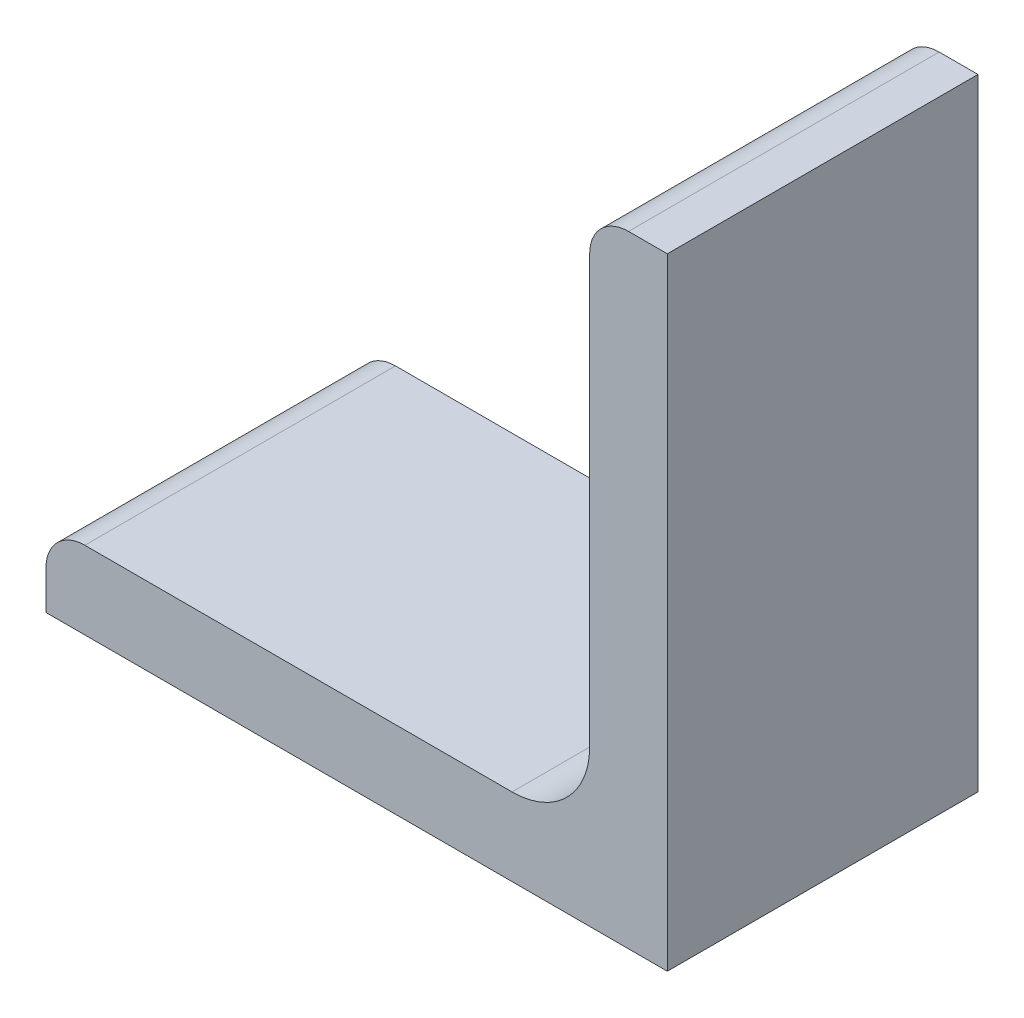
ISO-10303-21;
HEADER;
FILE_DESCRIPTION(('STEP AP214'),'2;1');
FILE_NAME('part.step','',(''),(''),'','','');
FILE_SCHEMA(('AUTOMOTIVE_DESIGN { 1 0 10303 214 1 1 1 1 }'));
ENDSEC;
DATA;
#1=APPLICATION_CONTEXT('core data for automotive mechanical design processes');
#2=APPLICATION_PROTOCOL_DEFINITION('international standard','automotive_design',2000,#1);
#3=PRODUCT_CONTEXT('',#1,'mechanical');
#4=PRODUCT('Part','Part','',(#3));
#5=PRODUCT_RELATED_PRODUCT_CATEGORY('part','',(#4));
#6=PRODUCT_DEFINITION_FORMATION('','',#4);
#7=PRODUCT_DEFINITION_CONTEXT('part definition',#1,'design');
#8=PRODUCT_DEFINITION('design','',#6,#7);
#9=PRODUCT_DEFINITION_SHAPE('','',#8);
#10=(LENGTH_UNIT() NAMED_UNIT(*) SI_UNIT(.MILLI.,.METRE.));
#11=(NAMED_UNIT(*) PLANE_ANGLE_UNIT() SI_UNIT($,.RADIAN.));
#12=(NAMED_UNIT(*) SI_UNIT($,.STERADIAN.) SOLID_ANGLE_UNIT());
#13=UNCERTAINTY_MEASURE_WITH_UNIT(LENGTH_MEASURE(1.E-05),#10,'distance_accuracy_value','');
#14=(GEOMETRIC_REPRESENTATION_CONTEXT(3) GLOBAL_UNCERTAINTY_ASSIGNED_CONTEXT((#13)) GLOBAL_UNIT_ASSIGNED_CONTEXT((#10,
#11,#12)) REPRESENTATION_CONTEXT('',''));
#15=CARTESIAN_POINT('',(0.,0.,0.));
#16=DIRECTION('',(0.,0.,1.));
#17=DIRECTION('',(1.,0.,0.));
#18=AXIS2_PLACEMENT_3D('',#15,#16,#17);
#19=CARTESIAN_POINT('',(-12.7,-11.1125,152.4));
#20=DIRECTION('',(1.,0.,0.));
#21=DIRECTION('',(0.,0.,-1.));
#22=AXIS2_PLACEMENT_3D('',#19,#20,#21);
#23=PLANE('',#22);
#24=DIRECTION('',(0.,0.,-1.));
#25=VECTOR('',#24,1.);
#26=CARTESIAN_POINT('',(-12.7,-11.1125,152.4));
#27=LINE('',#26,#25);
#28=CARTESIAN_POINT('',(-12.7,-11.1125,152.4));
#29=VERTEX_POINT('',#28);
#30=CARTESIAN_POINT('',(-12.7,-11.1125,139.7));
#31=VERTEX_POINT('',#30);
#32=EDGE_CURVE('E147',#29,#31,#27,.T.);
#33=ORIENTED_EDGE('',*,*,#32,.T.);
#34=DIRECTION('',(0.,-1.,0.));
#35=VECTOR('',#34,1.);
#36=CARTESIAN_POINT('',(-12.7,-11.1125,139.7));
#37=LINE('',#36,#35);
#38=CARTESIAN_POINT('',(-12.7,-12.7,139.7));
#39=VERTEX_POINT('',#38);
#40=EDGE_CURVE('E52',#31,#39,#37,.T.);
#41=ORIENTED_EDGE('',*,*,#40,.T.);
#42=DIRECTION('',(0.,0.,-1.));
#43=VECTOR('',#42,1.);
#44=CARTESIAN_POINT('',(-12.7,-12.7,152.4));
#45=LINE('',#44,#43);
#46=CARTESIAN_POINT('',(-12.7,-12.7,152.4));
#47=VERTEX_POINT('',#46);
#48=EDGE_CURVE('E45',#47,#39,#45,.T.);
#49=ORIENTED_EDGE('',*,*,#48,.F.);
#50=DIRECTION('',(0.,-1.,0.));
#51=VECTOR('',#50,1.);
#52=CARTESIAN_POINT('',(-12.7,-11.1125,152.4));
#53=LINE('',#52,#51);
#54=EDGE_CURVE('E116',#29,#47,#53,.T.);
#55=ORIENTED_EDGE('',*,*,#54,.F.);
#56=EDGE_LOOP('',(#33,#41,#49,#55));
#57=FACE_BOUND('',#56,.T.);
#58=ADVANCED_FACE('F38',(#57),#23,.F.);
#59=CARTESIAN_POINT('',(-12.7,-12.7,152.4));
#60=DIRECTION('',(0.,1.,0.));
#61=DIRECTION('',(-1.,0.,0.));
#62=AXIS2_PLACEMENT_3D('',#59,#60,#61);
#63=PLANE('',#62);
#64=ORIENTED_EDGE('',*,*,#48,.T.);
#65=DIRECTION('',(-1.,0.,0.));
#66=VECTOR('',#65,1.);
#67=CARTESIAN_POINT('',(-18.619943121302,-12.7,139.7));
#68=LINE('',#67,#66);
#69=CARTESIAN_POINT('',(12.7,-12.7,139.7));
#70=VERTEX_POINT('',#69);
#71=EDGE_CURVE('E109',#70,#39,#68,.T.);
#72=ORIENTED_EDGE('',*,*,#71,.F.);
#73=DIRECTION('',(0.,0.,-1.));
#74=VECTOR('',#73,1.);
#75=CARTESIAN_POINT('',(12.7,-12.7,152.4));
#76=LINE('',#75,#74);
#77=CARTESIAN_POINT('',(12.7,-12.7,152.4));
#78=VERTEX_POINT('',#77);
#79=EDGE_CURVE('E122',#78,#70,#76,.T.);
#80=ORIENTED_EDGE('',*,*,#79,.F.);
#81=DIRECTION('',(1.,0.,0.));
#82=VECTOR('',#81,1.);
#83=CARTESIAN_POINT('',(-12.7,-12.7,152.4));
#84=LINE('',#83,#82);
#85=EDGE_CURVE('E162',#47,#78,#84,.T.);
#86=ORIENTED_EDGE('',*,*,#85,.F.);
#87=EDGE_LOOP('',(#64,#72,#80,#86));
#88=FACE_BOUND('',#87,.T.);
#89=ADVANCED_FACE('F121',(#88),#63,.F.);
#90=CARTESIAN_POINT('',(12.7,-12.7,152.4));
#91=DIRECTION('',(-1.,0.,0.));
#92=DIRECTION('',(0.,-1.,0.));
#93=AXIS2_PLACEMENT_3D('',#90,#91,#92);
#94=PLANE('',#93);
#95=ORIENTED_EDGE('',*,*,#79,.T.);
#96=DIRECTION('',(0.,1.,0.));
#97=VECTOR('',#96,1.);
#98=CARTESIAN_POINT('',(12.7,-12.7,139.7));
#99=LINE('',#98,#97);
#100=CARTESIAN_POINT('',(12.7,12.7,139.7));
#101=VERTEX_POINT('',#100);
#102=EDGE_CURVE('E106',#70,#101,#99,.T.);
#103=ORIENTED_EDGE('',*,*,#102,.T.);
#104=DIRECTION('',(0.,0.,-1.));
#105=VECTOR('',#104,1.);
#106=CARTESIAN_POINT('',(12.7,12.7,152.4));
#107=LINE('',#106,#105);
#108=CARTESIAN_POINT('',(12.7,12.7,152.4));
#109=VERTEX_POINT('',#108);
#110=EDGE_CURVE('E128',#109,#101,#107,.T.);
#111=ORIENTED_EDGE('',*,*,#110,.F.);
#112=DIRECTION('',(0.,1.,0.));
#113=VECTOR('',#112,1.);
#114=CARTESIAN_POINT('',(12.7,-12.7,152.4));
#115=LINE('',#114,#113);
#116=EDGE_CURVE('E127',#78,#109,#115,.T.);
#117=ORIENTED_EDGE('',*,*,#116,.F.);
#118=EDGE_LOOP('',(#95,#103,#111,#117));
#119=FACE_BOUND('',#118,.T.);
#120=ADVANCED_FACE('F126',(#119),#94,.F.);
#121=CARTESIAN_POINT('',(11.1125,12.7,152.4));
#122=DIRECTION('',(0.,-1.,0.));
#123=DIRECTION('',(0.,0.,-1.));
#124=AXIS2_PLACEMENT_3D('',#121,#122,#123);
#125=PLANE('',#124);
#126=ORIENTED_EDGE('',*,*,#110,.T.);
#127=DIRECTION('',(-1.,0.,0.));
#128=VECTOR('',#127,1.);
#129=CARTESIAN_POINT('',(-18.619943121302,12.7,139.7));
#130=LINE('',#129,#128);
#131=CARTESIAN_POINT('',(11.1125,12.7,139.7));
#132=VERTEX_POINT('',#131);
#133=EDGE_CURVE('E111',#101,#132,#130,.T.);
#134=ORIENTED_EDGE('',*,*,#133,.T.);
#135=DIRECTION('',(0.,0.,-1.));
#136=VECTOR('',#135,1.);
#137=CARTESIAN_POINT('',(11.1125,12.7,152.4));
#138=LINE('',#137,#136);
#139=CARTESIAN_POINT('',(11.1125,12.7,152.4));
#140=VERTEX_POINT('',#139);
#141=EDGE_CURVE('E130',#140,#132,#138,.T.);
#142=ORIENTED_EDGE('',*,*,#141,.F.);
#143=DIRECTION('',(-1.,0.,0.));
#144=VECTOR('',#143,1.);
#145=CARTESIAN_POINT('',(11.1125,12.7,152.4));
#146=LINE('',#145,#144);
#147=EDGE_CURVE('E159',#109,#140,#146,.T.);
#148=ORIENTED_EDGE('',*,*,#147,.F.);
#149=EDGE_LOOP('',(#126,#134,#142,#148));
#150=FACE_BOUND('',#149,.T.);
#151=ADVANCED_FACE('F180',(#150),#125,.F.);
#152=CARTESIAN_POINT('',(11.1125,11.1125,152.4));
#153=DIRECTION('',(0.,0.,-1.));
#154=DIRECTION('',(-1.,0.,0.));
#155=AXIS2_PLACEMENT_3D('',#152,#153,#154);
#156=CYLINDRICAL_SURFACE('',#155,1.5875);
#157=ORIENTED_EDGE('',*,*,#141,.T.);
#158=CARTESIAN_POINT('',(11.1125,11.1125,139.7));
#159=DIRECTION('',(0.,0.,1.));
#160=DIRECTION('',(1.,0.,0.));
#161=AXIS2_PLACEMENT_3D('',#158,#159,#160);
#162=CIRCLE('',#161,1.5875);
#163=CARTESIAN_POINT('',(9.525,11.1125,139.7));
#164=VERTEX_POINT('',#163);
#165=EDGE_CURVE('E166',#132,#164,#162,.T.);
#166=ORIENTED_EDGE('',*,*,#165,.T.);
#167=DIRECTION('',(0.,0.,-1.));
#168=VECTOR('',#167,1.);
#169=CARTESIAN_POINT('',(9.525,11.1125,152.4));
#170=LINE('',#169,#168);
#171=CARTESIAN_POINT('',(9.525,11.1125,152.4));
#172=VERTEX_POINT('',#171);
#173=EDGE_CURVE('E135',#172,#164,#170,.T.);
#174=ORIENTED_EDGE('',*,*,#173,.F.);
#175=CARTESIAN_POINT('',(11.1125,11.1125,152.4));
#176=DIRECTION('',(0.,0.,1.));
#177=DIRECTION('',(-1.,0.,0.));
#178=AXIS2_PLACEMENT_3D('',#175,#176,#177);
#179=CIRCLE('',#178,1.5875);
#180=EDGE_CURVE('E157',#140,#172,#179,.T.);
#181=ORIENTED_EDGE('',*,*,#180,.F.);
#182=EDGE_LOOP('',(#157,#166,#174,#181));
#183=FACE_BOUND('',#182,.T.);
#184=ADVANCED_FACE('F184',(#183),#156,.T.);
#185=CARTESIAN_POINT('',(9.525,11.1125,152.4));
#186=DIRECTION('',(1.,0.,0.));
#187=DIRECTION('',(0.,1.,0.));
#188=AXIS2_PLACEMENT_3D('',#185,#186,#187);
#189=PLANE('',#188);
#190=ORIENTED_EDGE('',*,*,#173,.T.);
#191=DIRECTION('',(0.,-1.,0.));
#192=VECTOR('',#191,1.);
#193=CARTESIAN_POINT('',(9.525,11.1125,139.7));
#194=LINE('',#193,#192);
#195=CARTESIAN_POINT('',(9.525,-6.35,139.7));
#196=VERTEX_POINT('',#195);
#197=EDGE_CURVE('E169',#164,#196,#194,.T.);
#198=ORIENTED_EDGE('',*,*,#197,.T.);
#199=DIRECTION('',(0.,0.,-1.));
#200=VECTOR('',#199,1.);
#201=CARTESIAN_POINT('',(9.525,-6.35,152.4));
#202=LINE('',#201,#200);
#203=CARTESIAN_POINT('',(9.525,-6.35,152.4));
#204=VERTEX_POINT('',#203);
#205=EDGE_CURVE('E138',#204,#196,#202,.T.);
#206=ORIENTED_EDGE('',*,*,#205,.F.);
#207=DIRECTION('',(0.,-1.,0.));
#208=VECTOR('',#207,1.);
#209=CARTESIAN_POINT('',(9.525,11.1125,152.4));
#210=LINE('',#209,#208);
#211=EDGE_CURVE('E155',#172,#204,#210,.T.);
#212=ORIENTED_EDGE('',*,*,#211,.F.);
#213=EDGE_LOOP('',(#190,#198,#206,#212));
#214=FACE_BOUND('',#213,.T.);
#215=ADVANCED_FACE('F202',(#214),#189,.F.);
#216=CARTESIAN_POINT('',(6.35,-6.35,152.4));
#217=DIRECTION('',(0.,0.,-1.));
#218=DIRECTION('',(-1.,0.,0.));
#219=AXIS2_PLACEMENT_3D('',#216,#217,#218);
#220=CYLINDRICAL_SURFACE('',#219,3.175);
#221=ORIENTED_EDGE('',*,*,#205,.T.);
#222=CARTESIAN_POINT('',(6.35,-6.35,139.7));
#223=DIRECTION('',(0.,0.,1.));
#224=DIRECTION('',(1.,0.,0.));
#225=AXIS2_PLACEMENT_3D('',#222,#223,#224);
#226=CIRCLE('',#225,3.175);
#227=CARTESIAN_POINT('',(6.35,-9.525,139.7));
#228=VERTEX_POINT('',#227);
#229=EDGE_CURVE('E172',#196,#228,#226,.F.);
#230=ORIENTED_EDGE('',*,*,#229,.T.);
#231=DIRECTION('',(0.,0.,-1.));
#232=VECTOR('',#231,1.);
#233=CARTESIAN_POINT('',(6.35,-9.525,152.4));
#234=LINE('',#233,#232);
#235=CARTESIAN_POINT('',(6.35,-9.525,152.4));
#236=VERTEX_POINT('',#235);
#237=EDGE_CURVE('E141',#236,#228,#234,.T.);
#238=ORIENTED_EDGE('',*,*,#237,.F.);
#239=CARTESIAN_POINT('',(6.35,-6.35,152.4));
#240=DIRECTION('',(0.,0.,-1.));
#241=DIRECTION('',(-1.,0.,0.));
#242=AXIS2_PLACEMENT_3D('',#239,#240,#241);
#243=CIRCLE('',#242,3.175);
#244=EDGE_CURVE('E153',#204,#236,#243,.T.);
#245=ORIENTED_EDGE('',*,*,#244,.F.);
#246=EDGE_LOOP('',(#221,#230,#238,#245));
#247=FACE_BOUND('',#246,.T.);
#248=ADVANCED_FACE('F200',(#247),#220,.F.);
#249=CARTESIAN_POINT('',(6.35,-9.525,152.4));
#250=DIRECTION('',(0.,-1.,0.));
#251=DIRECTION('',(1.,0.,0.));
#252=AXIS2_PLACEMENT_3D('',#249,#250,#251);
#253=PLANE('',#252);
#254=ORIENTED_EDGE('',*,*,#237,.T.);
#255=DIRECTION('',(-1.,0.,0.));
#256=VECTOR('',#255,1.);
#257=CARTESIAN_POINT('',(6.34999999999999,-9.525,139.7));
#258=LINE('',#257,#256);
#259=CARTESIAN_POINT('',(-11.1125,-9.525,139.7));
#260=VERTEX_POINT('',#259);
#261=EDGE_CURVE('E175',#228,#260,#258,.T.);
#262=ORIENTED_EDGE('',*,*,#261,.T.);
#263=DIRECTION('',(0.,0.,-1.));
#264=VECTOR('',#263,1.);
#265=CARTESIAN_POINT('',(-11.1125,-9.525,152.4));
#266=LINE('',#265,#264);
#267=CARTESIAN_POINT('',(-11.1125,-9.525,152.4));
#268=VERTEX_POINT('',#267);
#269=EDGE_CURVE('E144',#268,#260,#266,.T.);
#270=ORIENTED_EDGE('',*,*,#269,.F.);
#271=DIRECTION('',(-1.,0.,0.));
#272=VECTOR('',#271,1.);
#273=CARTESIAN_POINT('',(6.35,-9.525,152.4));
#274=LINE('',#273,#272);
#275=EDGE_CURVE('E151',#236,#268,#274,.T.);
#276=ORIENTED_EDGE('',*,*,#275,.F.);
#277=EDGE_LOOP('',(#254,#262,#270,#276));
#278=FACE_BOUND('',#277,.T.);
#279=ADVANCED_FACE('F195',(#278),#253,.F.);
#280=CARTESIAN_POINT('',(-11.1125,-11.1125,152.4));
#281=DIRECTION('',(0.,0.,-1.));
#282=DIRECTION('',(-1.,0.,0.));
#283=AXIS2_PLACEMENT_3D('',#280,#281,#282);
#284=CYLINDRICAL_SURFACE('',#283,1.5875);
#285=ORIENTED_EDGE('',*,*,#269,.T.);
#286=CARTESIAN_POINT('',(-11.1125,-11.1125,139.7));
#287=DIRECTION('',(0.,0.,1.));
#288=DIRECTION('',(1.,0.,0.));
#289=AXIS2_PLACEMENT_3D('',#286,#287,#288);
#290=CIRCLE('',#289,1.5875);
#291=EDGE_CURVE('E11',#260,#31,#290,.T.);
#292=ORIENTED_EDGE('',*,*,#291,.T.);
#293=ORIENTED_EDGE('',*,*,#32,.F.);
#294=CARTESIAN_POINT('',(-11.1125,-11.1125,152.4));
#295=DIRECTION('',(0.,0.,1.));
#296=DIRECTION('',(-1.,0.,0.));
#297=AXIS2_PLACEMENT_3D('',#294,#295,#296);
#298=CIRCLE('',#297,1.5875);
#299=EDGE_CURVE('E59',#268,#29,#298,.T.);
#300=ORIENTED_EDGE('',*,*,#299,.F.);
#301=EDGE_LOOP('',(#285,#292,#293,#300));
#302=FACE_BOUND('',#301,.T.);
#303=ADVANCED_FACE('F192',(#302),#284,.T.);
#304=CARTESIAN_POINT('',(11.1125,11.1125,152.4));
#305=DIRECTION('',(0.,0.,-1.));
#306=DIRECTION('',(-1.,0.,0.));
#307=AXIS2_PLACEMENT_3D('',#304,#305,#306);
#308=PLANE('',#307);
#309=ORIENTED_EDGE('',*,*,#54,.T.);
#310=ORIENTED_EDGE('',*,*,#85,.T.);
#311=ORIENTED_EDGE('',*,*,#116,.T.);
#312=ORIENTED_EDGE('',*,*,#147,.T.);
#313=ORIENTED_EDGE('',*,*,#180,.T.);
#314=ORIENTED_EDGE('',*,*,#211,.T.);
#315=ORIENTED_EDGE('',*,*,#244,.T.);
#316=ORIENTED_EDGE('',*,*,#275,.T.);
#317=ORIENTED_EDGE('',*,*,#299,.T.);
#318=EDGE_LOOP('',(#309,#310,#311,#312,#313,#314,#315,#316,#317));
#319=FACE_BOUND('',#318,.T.);
#320=ADVANCED_FACE('F187',(#319),#308,.F.);
#321=CARTESIAN_POINT('',(-18.619943121302,12.7,139.7));
#322=DIRECTION('',(0.,0.,1.));
#323=DIRECTION('',(1.,0.,0.));
#324=AXIS2_PLACEMENT_3D('',#321,#322,#323);
#325=PLANE('',#324);
#326=ORIENTED_EDGE('',*,*,#71,.T.);
#327=ORIENTED_EDGE('',*,*,#40,.F.);
#328=ORIENTED_EDGE('',*,*,#291,.F.);
#329=ORIENTED_EDGE('',*,*,#261,.F.);
#330=ORIENTED_EDGE('',*,*,#229,.F.);
#331=ORIENTED_EDGE('',*,*,#197,.F.);
#332=ORIENTED_EDGE('',*,*,#165,.F.);
#333=ORIENTED_EDGE('',*,*,#133,.F.);
#334=ORIENTED_EDGE('',*,*,#102,.F.);
#335=EDGE_LOOP('',(#326,#327,#328,#329,#330,#331,#332,#333,#334));
#336=FACE_BOUND('',#335,.T.);
#337=ADVANCED_FACE('F108',(#336),#325,.F.);
#338=CLOSED_SHELL('',(#58,#89,#120,#151,#184,#215,#248,#279,#303,#320,#337));
#339=MANIFOLD_SOLID_BREP('B2',#338);
#340=ADVANCED_BREP_SHAPE_REPRESENTATION('',(#18,#339),#14);
#341=SHAPE_DEFINITION_REPRESENTATION(#9,#340);
ENDSEC;
END-ISO-10303-21;
